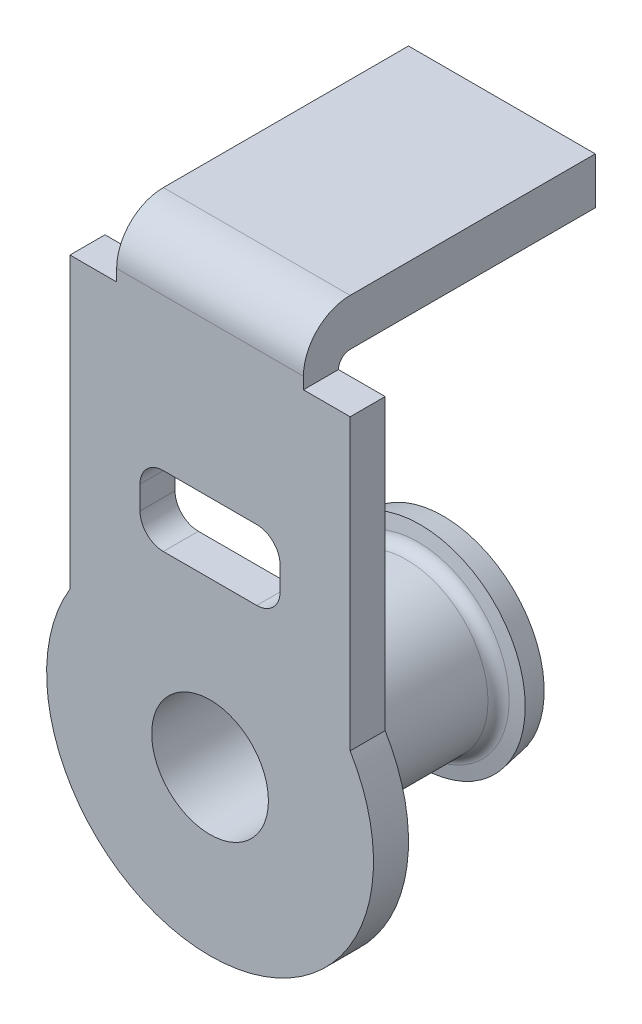
ISO-10303-21;
HEADER;
FILE_DESCRIPTION(('STEP AP214'),'2;1');
FILE_NAME('part.step','',(''),(''),'','','');
FILE_SCHEMA(('AUTOMOTIVE_DESIGN { 1 0 10303 214 1 1 1 1 }'));
ENDSEC;
DATA;
#1=APPLICATION_CONTEXT('core data for automotive mechanical design processes');
#2=APPLICATION_PROTOCOL_DEFINITION('international standard','automotive_design',2000,#1);
#3=PRODUCT_CONTEXT('',#1,'mechanical');
#4=PRODUCT('Part','Part','',(#3));
#5=PRODUCT_RELATED_PRODUCT_CATEGORY('part','',(#4));
#6=PRODUCT_DEFINITION_FORMATION('','',#4);
#7=PRODUCT_DEFINITION_CONTEXT('part definition',#1,'design');
#8=PRODUCT_DEFINITION('design','',#6,#7);
#9=PRODUCT_DEFINITION_SHAPE('','',#8);
#10=(LENGTH_UNIT() NAMED_UNIT(*) SI_UNIT(.MILLI.,.METRE.));
#11=(NAMED_UNIT(*) PLANE_ANGLE_UNIT() SI_UNIT($,.RADIAN.));
#12=(NAMED_UNIT(*) SI_UNIT($,.STERADIAN.) SOLID_ANGLE_UNIT());
#13=UNCERTAINTY_MEASURE_WITH_UNIT(LENGTH_MEASURE(1.E-05),#10,'distance_accuracy_value','');
#14=(GEOMETRIC_REPRESENTATION_CONTEXT(3) GLOBAL_UNCERTAINTY_ASSIGNED_CONTEXT((#13)) GLOBAL_UNIT_ASSIGNED_CONTEXT((#10,
#11,#12)) REPRESENTATION_CONTEXT('',''));
#15=CARTESIAN_POINT('',(0.,0.,0.));
#16=DIRECTION('',(0.,0.,1.));
#17=DIRECTION('',(1.,0.,0.));
#18=AXIS2_PLACEMENT_3D('',#15,#16,#17);
#19=CARTESIAN_POINT('',(0.,-1.,-7.84041232037));
#20=DIRECTION('',(0.,0.,1.));
#21=DIRECTION('',(1.,0.,0.));
#22=AXIS2_PLACEMENT_3D('',#19,#20,#21);
#23=TOROIDAL_SURFACE('',#22,0.400000000000007,0.0500000000000045);
#24=CARTESIAN_POINT('',(0.,-0.999999999999998,-7.88965270802));
#25=DIRECTION('',(0.,0.,-1.));
#26=DIRECTION('',(-1.,0.,0.));
#27=AXIS2_PLACEMENT_3D('',#24,#25,#26);
#28=CIRCLE('',#27,0.391317591117004);
#29=CARTESIAN_POINT('',(-0.391317591117001,-0.999999999999998,-7.88965270802));
#30=VERTEX_POINT('',#29);
#31=EDGE_CURVE('E210',#30,#30,#28,.T.);
#32=ORIENTED_EDGE('',*,*,#31,.F.);
#33=EDGE_LOOP('',(#32));
#34=FACE_BOUND('',#33,.T.);
#35=CARTESIAN_POINT('',(0.,-0.999999999999999,-7.84041232037));
#36=DIRECTION('',(0.,0.,1.));
#37=DIRECTION('',(1.,0.,0.));
#38=AXIS2_PLACEMENT_3D('',#35,#36,#37);
#39=CIRCLE('',#38,0.349999999999999);
#40=CARTESIAN_POINT('',(0.35,-0.999999999999999,-7.84041232037));
#41=VERTEX_POINT('',#40);
#42=EDGE_CURVE('E205',#41,#41,#39,.T.);
#43=ORIENTED_EDGE('',*,*,#42,.F.);
#44=EDGE_LOOP('',(#43));
#45=FACE_BOUND('',#44,.T.);
#46=ADVANCED_FACE('F17',(#34,#45),#23,.F.);
#47=CARTESIAN_POINT('',(0.,-1.,-7.8999999999988));
#48=DIRECTION('',(0.,0.,-1.));
#49=DIRECTION('',(-1.,0.,0.));
#50=AXIS2_PLACEMENT_3D('',#47,#48,#49);
#51=CONICAL_SURFACE('',#50,0.450000000000209,1.39626340160002);
#52=ORIENTED_EDGE('',*,*,#31,.T.);
#53=EDGE_LOOP('',(#52));
#54=FACE_BOUND('',#53,.T.);
#55=CARTESIAN_POINT('',(0.,-1.,-7.8999999999999));
#56=DIRECTION('',(0.,0.,-1.));
#57=DIRECTION('',(-1.,0.,0.));
#58=AXIS2_PLACEMENT_3D('',#55,#56,#57);
#59=CIRCLE('',#58,0.449999999999455);
#60=CARTESIAN_POINT('',(-0.449999999999459,-1.,-7.8999999999999));
#61=VERTEX_POINT('',#60);
#62=EDGE_CURVE('E175',#61,#61,#59,.T.);
#63=ORIENTED_EDGE('',*,*,#62,.F.);
#64=EDGE_LOOP('',(#63));
#65=FACE_BOUND('',#64,.T.);
#66=ADVANCED_FACE('F670',(#54,#65),#51,.T.);
#67=CARTESIAN_POINT('',(0.,-0.999999999999999,-7.15));
#68=DIRECTION('',(0.,0.,-1.));
#69=DIRECTION('',(-1.,0.,0.));
#70=AXIS2_PLACEMENT_3D('',#67,#68,#69);
#71=CYLINDRICAL_SURFACE('',#70,0.349999999999999);
#72=ORIENTED_EDGE('',*,*,#42,.T.);
#73=EDGE_LOOP('',(#72));
#74=FACE_BOUND('',#73,.T.);
#75=CARTESIAN_POINT('',(0.,-0.999999999999999,-7.15));
#76=DIRECTION('',(0.,0.,-1.));
#77=DIRECTION('',(-1.,0.,0.));
#78=AXIS2_PLACEMENT_3D('',#75,#76,#77);
#79=CIRCLE('',#78,0.349999999999999);
#80=CARTESIAN_POINT('',(-0.349999999999999,-0.999999999999999,-7.15));
#81=VERTEX_POINT('',#80);
#82=EDGE_CURVE('E21',#81,#81,#79,.F.);
#83=ORIENTED_EDGE('',*,*,#82,.F.);
#84=EDGE_LOOP('',(#83));
#85=FACE_BOUND('',#84,.T.);
#86=ADVANCED_FACE('F661',(#74,#85),#71,.T.);
#87=CARTESIAN_POINT('',(0.,-1.,-7.8999999999999));
#88=DIRECTION('',(0.,0.,1.));
#89=DIRECTION('',(1.,0.,0.));
#90=AXIS2_PLACEMENT_3D('',#87,#88,#89);
#91=CONICAL_SURFACE('',#90,0.449999999999456,0.174532925199069);
#92=CARTESIAN_POINT('',(0.,-0.999999999999997,-7.9984807752988));
#93=DIRECTION('',(0.,0.,-1.));
#94=DIRECTION('',(-1.,0.,0.));
#95=AXIS2_PLACEMENT_3D('',#92,#93,#94);
#96=CIRCLE('',#95,0.432635182233215);
#97=CARTESIAN_POINT('',(-0.432635182233211,-0.999999999999997,-7.9984807752988));
#98=VERTEX_POINT('',#97);
#99=EDGE_CURVE('E277',#98,#98,#96,.T.);
#100=ORIENTED_EDGE('',*,*,#99,.F.);
#101=EDGE_LOOP('',(#100));
#102=FACE_BOUND('',#101,.T.);
#103=ORIENTED_EDGE('',*,*,#62,.T.);
#104=EDGE_LOOP('',(#103));
#105=FACE_BOUND('',#104,.T.);
#106=ADVANCED_FACE('F653',(#102,#105),#91,.T.);
#107=CARTESIAN_POINT('',(0.401,0.649771809401,-7.199));
#108=DIRECTION('',(0.,-1.,0.));
#109=DIRECTION('',(-1.,0.,0.));
#110=AXIS2_PLACEMENT_3D('',#107,#108,#109);
#111=PLANE('',#110);
#112=DIRECTION('',(-1.,0.,0.));
#113=VECTOR('',#112,1.);
#114=CARTESIAN_POINT('',(0.,0.649771809401,-8.25));
#115=LINE('',#114,#113);
#116=CARTESIAN_POINT('',(0.4,0.649771809401,-8.25));
#117=VERTEX_POINT('',#116);
#118=CARTESIAN_POINT('',(-0.4,0.649771809401,-8.25));
#119=VERTEX_POINT('',#118);
#120=EDGE_CURVE('E136',#117,#119,#115,.T.);
#121=ORIENTED_EDGE('',*,*,#120,.F.);
#122=DIRECTION('',(0.,0.,-1.));
#123=VECTOR('',#122,1.);
#124=CARTESIAN_POINT('',(0.4,0.649771809401,-7.625));
#125=LINE('',#124,#123);
#126=CARTESIAN_POINT('',(0.4,0.649771809401,-7.2));
#127=VERTEX_POINT('',#126);
#128=EDGE_CURVE('E165',#127,#117,#125,.T.);
#129=ORIENTED_EDGE('',*,*,#128,.F.);
#130=DIRECTION('',(1.,0.,0.));
#131=VECTOR('',#130,1.);
#132=CARTESIAN_POINT('',(0.,0.649771809401,-7.2));
#133=LINE('',#132,#131);
#134=CARTESIAN_POINT('',(-0.4,0.649771809401,-7.2));
#135=VERTEX_POINT('',#134);
#136=EDGE_CURVE('E126',#135,#127,#133,.T.);
#137=ORIENTED_EDGE('',*,*,#136,.F.);
#138=DIRECTION('',(0.,0.,1.));
#139=VECTOR('',#138,1.);
#140=CARTESIAN_POINT('',(-0.4,0.649771809401,-7.625));
#141=LINE('',#140,#139);
#142=EDGE_CURVE('E199',#119,#135,#141,.T.);
#143=ORIENTED_EDGE('',*,*,#142,.F.);
#144=EDGE_LOOP('',(#121,#129,#137,#143));
#145=FACE_BOUND('',#144,.T.);
#146=ADVANCED_FACE('F645',(#145),#111,.T.);
#147=CARTESIAN_POINT('',(-0.401,0.851,-8.25));
#148=DIRECTION('',(0.,0.,-1.));
#149=DIRECTION('',(1.,0.,0.));
#150=AXIS2_PLACEMENT_3D('',#147,#148,#149);
#151=PLANE('',#150);
#152=DIRECTION('',(-1.,0.,0.));
#153=VECTOR('',#152,1.);
#154=CARTESIAN_POINT('',(0.,0.85,-8.25));
#155=LINE('',#154,#153);
#156=CARTESIAN_POINT('',(0.4,0.85,-8.25));
#157=VERTEX_POINT('',#156);
#158=CARTESIAN_POINT('',(-0.4,0.85,-8.25));
#159=VERTEX_POINT('',#158);
#160=EDGE_CURVE('E141',#157,#159,#155,.T.);
#161=ORIENTED_EDGE('',*,*,#160,.F.);
#162=DIRECTION('',(0.,1.,0.));
#163=VECTOR('',#162,1.);
#164=CARTESIAN_POINT('',(0.4,0.7248859047005,-8.25));
#165=LINE('',#164,#163);
#166=EDGE_CURVE('E145',#117,#157,#165,.T.);
#167=ORIENTED_EDGE('',*,*,#166,.F.);
#168=ORIENTED_EDGE('',*,*,#120,.T.);
#169=DIRECTION('',(0.,-1.,0.));
#170=VECTOR('',#169,1.);
#171=CARTESIAN_POINT('',(-0.4,0.7248859047005,-8.25));
#172=LINE('',#171,#170);
#173=EDGE_CURVE('E148',#159,#119,#172,.T.);
#174=ORIENTED_EDGE('',*,*,#173,.F.);
#175=EDGE_LOOP('',(#161,#167,#168,#174));
#176=FACE_BOUND('',#175,.T.);
#177=ADVANCED_FACE('F143',(#176),#151,.T.);
#178=CARTESIAN_POINT('',(-0.4,0.599771809401,-7.2));
#179=DIRECTION('',(1.,0.,0.));
#180=DIRECTION('',(0.,0.,-1.));
#181=AXIS2_PLACEMENT_3D('',#178,#179,#180);
#182=CYLINDRICAL_SURFACE('',#181,0.0500000000000007);
#183=ORIENTED_EDGE('',*,*,#136,.T.);
#184=CARTESIAN_POINT('',(0.4,0.599771809401,-7.2));
#185=DIRECTION('',(1.,0.,0.));
#186=DIRECTION('',(0.,0.,-1.));
#187=AXIS2_PLACEMENT_3D('',#184,#185,#186);
#188=CIRCLE('',#187,0.0500000000000007);
#189=CARTESIAN_POINT('',(0.4,0.599771809401,-7.15));
#190=VERTEX_POINT('',#189);
#191=EDGE_CURVE('E258',#190,#127,#188,.F.);
#192=ORIENTED_EDGE('',*,*,#191,.F.);
#193=DIRECTION('',(1.,0.,0.));
#194=VECTOR('',#193,1.);
#195=CARTESIAN_POINT('',(0.,0.599771809401,-7.15));
#196=LINE('',#195,#194);
#197=CARTESIAN_POINT('',(-0.4,0.599771809401,-7.15));
#198=VERTEX_POINT('',#197);
#199=EDGE_CURVE('E151',#198,#190,#196,.T.);
#200=ORIENTED_EDGE('',*,*,#199,.F.);
#201=CARTESIAN_POINT('',(-0.4,0.599771809401,-7.2));
#202=DIRECTION('',(1.,0.,0.));
#203=DIRECTION('',(0.,0.,-1.));
#204=AXIS2_PLACEMENT_3D('',#201,#202,#203);
#205=CIRCLE('',#204,0.0500000000000007);
#206=EDGE_CURVE('E261',#135,#198,#205,.T.);
#207=ORIENTED_EDGE('',*,*,#206,.F.);
#208=EDGE_LOOP('',(#183,#192,#200,#207));
#209=FACE_BOUND('',#208,.T.);
#210=ADVANCED_FACE('F629',(#209),#182,.F.);
#211=CARTESIAN_POINT('',(0.401,0.85,-8.251));
#212=DIRECTION('',(0.,1.,0.));
#213=DIRECTION('',(-1.,0.,0.));
#214=AXIS2_PLACEMENT_3D('',#211,#212,#213);
#215=PLANE('',#214);
#216=ORIENTED_EDGE('',*,*,#160,.T.);
#217=DIRECTION('',(0.,0.,-1.));
#218=VECTOR('',#217,1.);
#219=CARTESIAN_POINT('',(-0.4,0.85,-7.625));
#220=LINE('',#219,#218);
#221=CARTESIAN_POINT('',(-0.4,0.85,-7.2));
#222=VERTEX_POINT('',#221);
#223=EDGE_CURVE('E200',#222,#159,#220,.T.);
#224=ORIENTED_EDGE('',*,*,#223,.F.);
#225=DIRECTION('',(-1.,0.,0.));
#226=VECTOR('',#225,1.);
#227=CARTESIAN_POINT('',(0.,0.85,-7.2));
#228=LINE('',#227,#226);
#229=CARTESIAN_POINT('',(0.4,0.85,-7.2));
#230=VERTEX_POINT('',#229);
#231=EDGE_CURVE('E157',#230,#222,#228,.T.);
#232=ORIENTED_EDGE('',*,*,#231,.F.);
#233=DIRECTION('',(0.,0.,1.));
#234=VECTOR('',#233,1.);
#235=CARTESIAN_POINT('',(0.4,0.85,-7.625));
#236=LINE('',#235,#234);
#237=EDGE_CURVE('E154',#157,#230,#236,.T.);
#238=ORIENTED_EDGE('',*,*,#237,.F.);
#239=EDGE_LOOP('',(#216,#224,#232,#238));
#240=FACE_BOUND('',#239,.T.);
#241=ADVANCED_FACE('F155',(#240),#215,.T.);
#242=CARTESIAN_POINT('',(0.907143603825974,-1.91929572084614,-7.15));
#243=DIRECTION('',(0.,0.,-1.));
#244=DIRECTION('',(-1.,0.,0.));
#245=AXIS2_PLACEMENT_3D('',#242,#243,#244);
#246=PLANE('',#245);
#247=CARTESIAN_POINT('',(0.2,-0.2,-7.15));
#248=DIRECTION('',(0.,0.,1.));
#249=DIRECTION('',(1.,0.,0.));
#250=AXIS2_PLACEMENT_3D('',#247,#248,#249);
#251=CIRCLE('',#250,0.1);
#252=CARTESIAN_POINT('',(0.3,-0.2,-7.15));
#253=VERTEX_POINT('',#252);
#254=CARTESIAN_POINT('',(0.2,-0.3,-7.15));
#255=VERTEX_POINT('',#254);
#256=EDGE_CURVE('E246',#253,#255,#251,.F.);
#257=ORIENTED_EDGE('',*,*,#256,.F.);
#258=DIRECTION('',(0.,-1.,0.));
#259=VECTOR('',#258,1.);
#260=CARTESIAN_POINT('',(0.3,-0.15,-7.15));
#261=LINE('',#260,#259);
#262=CARTESIAN_POINT('',(0.3,-0.1,-7.15));
#263=VERTEX_POINT('',#262);
#264=EDGE_CURVE('E292',#263,#253,#261,.T.);
#265=ORIENTED_EDGE('',*,*,#264,.F.);
#266=CARTESIAN_POINT('',(0.2,-0.1,-7.15));
#267=DIRECTION('',(0.,0.,1.));
#268=DIRECTION('',(1.,0.,0.));
#269=AXIS2_PLACEMENT_3D('',#266,#267,#268);
#270=CIRCLE('',#269,0.1);
#271=CARTESIAN_POINT('',(0.2,0.,-7.15));
#272=VERTEX_POINT('',#271);
#273=EDGE_CURVE('E250',#272,#263,#270,.F.);
#274=ORIENTED_EDGE('',*,*,#273,.F.);
#275=DIRECTION('',(1.,0.,0.));
#276=VECTOR('',#275,1.);
#277=CARTESIAN_POINT('',(0.,0.,-7.15));
#278=LINE('',#277,#276);
#279=CARTESIAN_POINT('',(-0.2,0.,-7.15));
#280=VERTEX_POINT('',#279);
#281=EDGE_CURVE('E284',#280,#272,#278,.T.);
#282=ORIENTED_EDGE('',*,*,#281,.F.);
#283=CARTESIAN_POINT('',(-0.2,-0.1,-7.15));
#284=DIRECTION('',(0.,0.,1.));
#285=DIRECTION('',(0.,-1.,0.));
#286=AXIS2_PLACEMENT_3D('',#283,#284,#285);
#287=CIRCLE('',#286,0.1);
#288=CARTESIAN_POINT('',(-0.3,-0.1,-7.15));
#289=VERTEX_POINT('',#288);
#290=EDGE_CURVE('E239',#289,#280,#287,.F.);
#291=ORIENTED_EDGE('',*,*,#290,.F.);
#292=DIRECTION('',(0.,1.,0.));
#293=VECTOR('',#292,1.);
#294=CARTESIAN_POINT('',(-0.3,-0.15,-7.15));
#295=LINE('',#294,#293);
#296=CARTESIAN_POINT('',(-0.3,-0.2,-7.15));
#297=VERTEX_POINT('',#296);
#298=EDGE_CURVE('E288',#297,#289,#295,.T.);
#299=ORIENTED_EDGE('',*,*,#298,.F.);
#300=CARTESIAN_POINT('',(-0.2,-0.2,-7.15));
#301=DIRECTION('',(0.,0.,1.));
#302=DIRECTION('',(1.,0.,0.));
#303=AXIS2_PLACEMENT_3D('',#300,#301,#302);
#304=CIRCLE('',#303,0.1);
#305=CARTESIAN_POINT('',(-0.2,-0.3,-7.15));
#306=VERTEX_POINT('',#305);
#307=EDGE_CURVE('E242',#306,#297,#304,.F.);
#308=ORIENTED_EDGE('',*,*,#307,.F.);
#309=DIRECTION('',(-1.,0.,0.));
#310=VECTOR('',#309,1.);
#311=CARTESIAN_POINT('',(0.,-0.3,-7.15));
#312=LINE('',#311,#310);
#313=EDGE_CURVE('E290',#255,#306,#312,.T.);
#314=ORIENTED_EDGE('',*,*,#313,.F.);
#315=EDGE_LOOP('',(#257,#265,#274,#282,#291,#299,#308,#314));
#316=FACE_BOUND('',#315,.T.);
#317=ORIENTED_EDGE('',*,*,#82,.T.);
#318=EDGE_LOOP('',(#317));
#319=FACE_BOUND('',#318,.T.);
#320=DIRECTION('',(0.,-1.,0.));
#321=VECTOR('',#320,1.);
#322=CARTESIAN_POINT('',(-0.6,-0.0198365315265,-7.15));
#323=LINE('',#322,#321);
#324=CARTESIAN_POINT('',(-0.6,0.599771809401,-7.15));
#325=VERTEX_POINT('',#324);
#326=CARTESIAN_POINT('',(-0.599999999999969,-0.639444872453546,-7.15));
#327=VERTEX_POINT('',#326);
#328=EDGE_CURVE('E186',#325,#327,#323,.T.);
#329=ORIENTED_EDGE('',*,*,#328,.F.);
#330=DIRECTION('',(-1.,0.,0.));
#331=VECTOR('',#330,1.);
#332=CARTESIAN_POINT('',(-0.5,0.599771809401,-7.15));
#333=LINE('',#332,#331);
#334=EDGE_CURVE('E192',#198,#325,#333,.T.);
#335=ORIENTED_EDGE('',*,*,#334,.F.);
#336=ORIENTED_EDGE('',*,*,#199,.T.);
#337=DIRECTION('',(-1.,0.,0.));
#338=VECTOR('',#337,1.);
#339=CARTESIAN_POINT('',(0.5,0.599771809401,-7.15));
#340=LINE('',#339,#338);
#341=CARTESIAN_POINT('',(0.6,0.599771809401,-7.15));
#342=VERTEX_POINT('',#341);
#343=EDGE_CURVE('E167',#342,#190,#340,.T.);
#344=ORIENTED_EDGE('',*,*,#343,.F.);
#345=DIRECTION('',(0.,1.,0.));
#346=VECTOR('',#345,1.);
#347=CARTESIAN_POINT('',(0.6,-0.0198365315265,-7.15));
#348=LINE('',#347,#346);
#349=CARTESIAN_POINT('',(0.6,-0.639444872453222,-7.15));
#350=VERTEX_POINT('',#349);
#351=EDGE_CURVE('E179',#350,#342,#348,.T.);
#352=ORIENTED_EDGE('',*,*,#351,.F.);
#353=CARTESIAN_POINT('',(3.4577917785994E-13,-0.999999999999935,-7.15));
#354=DIRECTION('',(0.,0.,-1.));
#355=DIRECTION('',(-1.,0.,0.));
#356=AXIS2_PLACEMENT_3D('',#353,#354,#355);
#357=CIRCLE('',#356,0.700000000000267);
#358=EDGE_CURVE('E260',#327,#350,#357,.F.);
#359=ORIENTED_EDGE('',*,*,#358,.F.);
#360=EDGE_LOOP('',(#329,#335,#336,#344,#352,#359));
#361=FACE_BOUND('',#360,.T.);
#362=ADVANCED_FACE('F396',(#316,#319,#361),#246,.T.);
#363=CARTESIAN_POINT('',(0.,-0.999999999999999,-7.98813348332));
#364=DIRECTION('',(0.,0.,-1.));
#365=DIRECTION('',(-1.,0.,0.));
#366=AXIS2_PLACEMENT_3D('',#363,#364,#365);
#367=CONICAL_SURFACE('',#366,0.373952773349999,1.39626340160007);
#368=ORIENTED_EDGE('',*,*,#99,.T.);
#369=EDGE_LOOP('',(#368));
#370=FACE_BOUND('',#369,.T.);
#371=CARTESIAN_POINT('',(0.,-1.,-7.98813348332178));
#372=DIRECTION('',(0.,0.,-1.));
#373=DIRECTION('',(-1.,0.,0.));
#374=AXIS2_PLACEMENT_3D('',#371,#372,#373);
#375=CIRCLE('',#374,0.373952773349689);
#376=CARTESIAN_POINT('',(-0.373952773349692,-1.,-7.98813348332178));
#377=VERTEX_POINT('',#376);
#378=EDGE_CURVE('E329',#377,#377,#375,.T.);
#379=ORIENTED_EDGE('',*,*,#378,.F.);
#380=EDGE_LOOP('',(#379));
#381=FACE_BOUND('',#380,.T.);
#382=ADVANCED_FACE('F411',(#370,#381),#367,.F.);
#383=CARTESIAN_POINT('',(-0.4,0.598771809401,-6.999));
#384=DIRECTION('',(-1.,0.,0.));
#385=DIRECTION('',(0.,1.,0.));
#386=AXIS2_PLACEMENT_3D('',#383,#384,#385);
#387=PLANE('',#386);
#388=ORIENTED_EDGE('',*,*,#142,.T.);
#389=ORIENTED_EDGE('',*,*,#206,.T.);
#390=DIRECTION('',(0.,0.,-1.));
#391=VECTOR('',#390,1.);
#392=CARTESIAN_POINT('',(-0.4,0.599771809401,-7.075));
#393=LINE('',#392,#391);
#394=CARTESIAN_POINT('',(-0.4,0.599771809401,-7.));
#395=VERTEX_POINT('',#394);
#396=EDGE_CURVE('E195',#395,#198,#393,.T.);
#397=ORIENTED_EDGE('',*,*,#396,.F.);
#398=DIRECTION('',(0.,-1.,0.));
#399=VECTOR('',#398,1.);
#400=CARTESIAN_POINT('',(-0.4,-0.63414786042307,-7.));
#401=LINE('',#400,#399);
#402=CARTESIAN_POINT('',(-0.4,0.65,-7.));
#403=VERTEX_POINT('',#402);
#404=EDGE_CURVE('E324',#403,#395,#401,.T.);
#405=ORIENTED_EDGE('',*,*,#404,.F.);
#406=CARTESIAN_POINT('',(-0.4,0.650000000000001,-7.2));
#407=DIRECTION('',(-1.,0.,0.));
#408=DIRECTION('',(0.,0.,1.));
#409=AXIS2_PLACEMENT_3D('',#406,#407,#408);
#410=CIRCLE('',#409,0.2);
#411=EDGE_CURVE('E253',#222,#403,#410,.F.);
#412=ORIENTED_EDGE('',*,*,#411,.F.);
#413=ORIENTED_EDGE('',*,*,#223,.T.);
#414=ORIENTED_EDGE('',*,*,#173,.T.);
#415=EDGE_LOOP('',(#388,#389,#397,#405,#412,#413,#414));
#416=FACE_BOUND('',#415,.T.);
#417=ADVANCED_FACE('F409',(#416),#387,.T.);
#418=CARTESIAN_POINT('',(-0.399,0.599771809401,-7.151));
#419=DIRECTION('',(0.,1.,0.));
#420=DIRECTION('',(-1.,0.,0.));
#421=AXIS2_PLACEMENT_3D('',#418,#419,#420);
#422=PLANE('',#421);
#423=ORIENTED_EDGE('',*,*,#334,.T.);
#424=DIRECTION('',(0.,0.,-1.));
#425=VECTOR('',#424,1.);
#426=CARTESIAN_POINT('',(-0.6,0.599771809401,-7.075));
#427=LINE('',#426,#425);
#428=CARTESIAN_POINT('',(-0.6,0.599771809401,-7.));
#429=VERTEX_POINT('',#428);
#430=EDGE_CURVE('E189',#429,#325,#427,.T.);
#431=ORIENTED_EDGE('',*,*,#430,.F.);
#432=DIRECTION('',(-1.,0.,0.));
#433=VECTOR('',#432,1.);
#434=CARTESIAN_POINT('',(0.,0.599771809401,-7.));
#435=LINE('',#434,#433);
#436=EDGE_CURVE('E321',#395,#429,#435,.T.);
#437=ORIENTED_EDGE('',*,*,#436,.F.);
#438=ORIENTED_EDGE('',*,*,#396,.T.);
#439=EDGE_LOOP('',(#423,#431,#437,#438));
#440=FACE_BOUND('',#439,.T.);
#441=ADVANCED_FACE('F393',(#440),#422,.T.);
#442=CARTESIAN_POINT('',(-0.6,0.600771809401,-7.151));
#443=DIRECTION('',(-1.,0.,0.));
#444=DIRECTION('',(0.,-1.,0.));
#445=AXIS2_PLACEMENT_3D('',#442,#443,#444);
#446=PLANE('',#445);
#447=DIRECTION('',(0.,0.,-1.));
#448=VECTOR('',#447,1.);
#449=CARTESIAN_POINT('',(-0.599999999999938,-0.639444872453498,-7.075));
#450=LINE('',#449,#448);
#451=CARTESIAN_POINT('',(-0.599999999999969,-0.639444872453547,-7.));
#452=VERTEX_POINT('',#451);
#453=EDGE_CURVE('E188',#452,#327,#450,.T.);
#454=ORIENTED_EDGE('',*,*,#453,.F.);
#455=DIRECTION('',(0.,-1.,0.));
#456=VECTOR('',#455,1.);
#457=CARTESIAN_POINT('',(-0.6,-0.63414786042307,-7.));
#458=LINE('',#457,#456);
#459=EDGE_CURVE('E238',#429,#452,#458,.T.);
#460=ORIENTED_EDGE('',*,*,#459,.F.);
#461=ORIENTED_EDGE('',*,*,#430,.T.);
#462=ORIENTED_EDGE('',*,*,#328,.T.);
#463=EDGE_LOOP('',(#454,#460,#461,#462));
#464=FACE_BOUND('',#463,.T.);
#465=ADVANCED_FACE('F384',(#464),#446,.T.);
#466=CARTESIAN_POINT('',(3.4577917785994E-13,-0.999999999999935,-7.));
#467=DIRECTION('',(0.,0.,-1.));
#468=DIRECTION('',(-1.,0.,0.));
#469=AXIS2_PLACEMENT_3D('',#466,#467,#468);
#470=CYLINDRICAL_SURFACE('',#469,0.700000000000267);
#471=DIRECTION('',(0.,0.,-1.));
#472=VECTOR('',#471,1.);
#473=CARTESIAN_POINT('',(0.6,-0.639444872454,-7.075));
#474=LINE('',#473,#472);
#475=CARTESIAN_POINT('',(0.6,-0.639444872453222,-7.));
#476=VERTEX_POINT('',#475);
#477=EDGE_CURVE('E183',#476,#350,#474,.T.);
#478=ORIENTED_EDGE('',*,*,#477,.F.);
#479=CARTESIAN_POINT('',(3.4577917785994E-13,-0.999999999999935,-7.));
#480=DIRECTION('',(0.,0.,-1.));
#481=DIRECTION('',(-1.,0.,0.));
#482=AXIS2_PLACEMENT_3D('',#479,#480,#481);
#483=CIRCLE('',#482,0.700000000000267);
#484=EDGE_CURVE('E234',#452,#476,#483,.F.);
#485=ORIENTED_EDGE('',*,*,#484,.F.);
#486=ORIENTED_EDGE('',*,*,#453,.T.);
#487=ORIENTED_EDGE('',*,*,#358,.T.);
#488=EDGE_LOOP('',(#478,#485,#486,#487));
#489=FACE_BOUND('',#488,.T.);
#490=ADVANCED_FACE('F399',(#489),#470,.T.);
#491=CARTESIAN_POINT('',(0.6,-0.640444872454,-7.151));
#492=DIRECTION('',(1.,0.,0.));
#493=DIRECTION('',(0.,1.,0.));
#494=AXIS2_PLACEMENT_3D('',#491,#492,#493);
#495=PLANE('',#494);
#496=ORIENTED_EDGE('',*,*,#477,.T.);
#497=ORIENTED_EDGE('',*,*,#351,.T.);
#498=DIRECTION('',(0.,0.,-1.));
#499=VECTOR('',#498,1.);
#500=CARTESIAN_POINT('',(0.6,0.599771809401,-7.075));
#501=LINE('',#500,#499);
#502=CARTESIAN_POINT('',(0.6,0.599771809401,-7.));
#503=VERTEX_POINT('',#502);
#504=EDGE_CURVE('E182',#503,#342,#501,.T.);
#505=ORIENTED_EDGE('',*,*,#504,.F.);
#506=DIRECTION('',(0.,1.,0.));
#507=VECTOR('',#506,1.);
#508=CARTESIAN_POINT('',(0.6,-0.63414786042307,-7.));
#509=LINE('',#508,#507);
#510=EDGE_CURVE('E237',#476,#503,#509,.T.);
#511=ORIENTED_EDGE('',*,*,#510,.F.);
#512=EDGE_LOOP('',(#496,#497,#505,#511));
#513=FACE_BOUND('',#512,.T.);
#514=ADVANCED_FACE('F401',(#513),#495,.T.);
#515=CARTESIAN_POINT('',(0.601,0.599771809401,-7.151));
#516=DIRECTION('',(0.,1.,0.));
#517=DIRECTION('',(-1.,0.,0.));
#518=AXIS2_PLACEMENT_3D('',#515,#516,#517);
#519=PLANE('',#518);
#520=ORIENTED_EDGE('',*,*,#343,.T.);
#521=DIRECTION('',(0.,0.,-1.));
#522=VECTOR('',#521,1.);
#523=CARTESIAN_POINT('',(0.4,0.599771809401,-7.625));
#524=LINE('',#523,#522);
#525=CARTESIAN_POINT('',(0.4,0.599771809401,-7.));
#526=VERTEX_POINT('',#525);
#527=EDGE_CURVE('E160',#526,#190,#524,.T.);
#528=ORIENTED_EDGE('',*,*,#527,.F.);
#529=DIRECTION('',(-1.,0.,0.));
#530=VECTOR('',#529,1.);
#531=CARTESIAN_POINT('',(0.,0.599771809401,-7.));
#532=LINE('',#531,#530);
#533=EDGE_CURVE('E368',#503,#526,#532,.T.);
#534=ORIENTED_EDGE('',*,*,#533,.F.);
#535=ORIENTED_EDGE('',*,*,#504,.T.);
#536=EDGE_LOOP('',(#520,#528,#534,#535));
#537=FACE_BOUND('',#536,.T.);
#538=ADVANCED_FACE('F402',(#537),#519,.T.);
#539=CARTESIAN_POINT('',(0.4,0.851,-6.999));
#540=DIRECTION('',(1.,0.,0.));
#541=DIRECTION('',(0.,-1.,0.));
#542=AXIS2_PLACEMENT_3D('',#539,#540,#541);
#543=PLANE('',#542);
#544=ORIENTED_EDGE('',*,*,#527,.T.);
#545=ORIENTED_EDGE('',*,*,#191,.T.);
#546=ORIENTED_EDGE('',*,*,#128,.T.);
#547=ORIENTED_EDGE('',*,*,#166,.T.);
#548=ORIENTED_EDGE('',*,*,#237,.T.);
#549=CARTESIAN_POINT('',(0.4,0.650000000000001,-7.2));
#550=DIRECTION('',(-1.,0.,0.));
#551=DIRECTION('',(0.,0.,1.));
#552=AXIS2_PLACEMENT_3D('',#549,#550,#551);
#553=CIRCLE('',#552,0.2);
#554=CARTESIAN_POINT('',(0.4,0.65,-7.));
#555=VERTEX_POINT('',#554);
#556=EDGE_CURVE('E256',#555,#230,#553,.T.);
#557=ORIENTED_EDGE('',*,*,#556,.F.);
#558=DIRECTION('',(0.,1.,0.));
#559=VECTOR('',#558,1.);
#560=CARTESIAN_POINT('',(0.4,-0.63414786042307,-7.));
#561=LINE('',#560,#559);
#562=EDGE_CURVE('E365',#526,#555,#561,.T.);
#563=ORIENTED_EDGE('',*,*,#562,.F.);
#564=EDGE_LOOP('',(#544,#545,#546,#547,#548,#557,#563));
#565=FACE_BOUND('',#564,.T.);
#566=ADVANCED_FACE('F163',(#565),#543,.T.);
#567=CARTESIAN_POINT('',(0.4,0.650000000000001,-7.2));
#568=DIRECTION('',(-1.,0.,0.));
#569=DIRECTION('',(0.,0.,1.));
#570=AXIS2_PLACEMENT_3D('',#567,#568,#569);
#571=CYLINDRICAL_SURFACE('',#570,0.2);
#572=ORIENTED_EDGE('',*,*,#411,.T.);
#573=DIRECTION('',(-1.,0.,0.));
#574=VECTOR('',#573,1.);
#575=CARTESIAN_POINT('',(0.,0.65,-7.));
#576=LINE('',#575,#574);
#577=EDGE_CURVE('E233',#555,#403,#576,.T.);
#578=ORIENTED_EDGE('',*,*,#577,.F.);
#579=ORIENTED_EDGE('',*,*,#556,.T.);
#580=ORIENTED_EDGE('',*,*,#231,.T.);
#581=EDGE_LOOP('',(#572,#578,#579,#580));
#582=FACE_BOUND('',#581,.T.);
#583=ADVANCED_FACE('F407',(#582),#571,.T.);
#584=CARTESIAN_POINT('',(0.2,-0.1,-7.15));
#585=DIRECTION('',(0.,0.,1.));
#586=DIRECTION('',(1.,0.,0.));
#587=AXIS2_PLACEMENT_3D('',#584,#585,#586);
#588=CYLINDRICAL_SURFACE('',#587,0.1);
#589=ORIENTED_EDGE('',*,*,#273,.T.);
#590=DIRECTION('',(0.,0.,-1.));
#591=VECTOR('',#590,1.);
#592=CARTESIAN_POINT('',(0.3,-0.1,-7.075));
#593=LINE('',#592,#591);
#594=CARTESIAN_POINT('',(0.3,-0.1,-7.));
#595=VERTEX_POINT('',#594);
#596=EDGE_CURVE('E252',#595,#263,#593,.T.);
#597=ORIENTED_EDGE('',*,*,#596,.F.);
#598=CARTESIAN_POINT('',(0.2,-0.1,-7.));
#599=DIRECTION('',(0.,0.,1.));
#600=DIRECTION('',(1.,0.,0.));
#601=AXIS2_PLACEMENT_3D('',#598,#599,#600);
#602=CIRCLE('',#601,0.1);
#603=CARTESIAN_POINT('',(0.2,0.,-7.));
#604=VERTEX_POINT('',#603);
#605=EDGE_CURVE('E230',#604,#595,#602,.F.);
#606=ORIENTED_EDGE('',*,*,#605,.F.);
#607=DIRECTION('',(0.,0.,1.));
#608=VECTOR('',#607,1.);
#609=CARTESIAN_POINT('',(0.2,0.,-7.075));
#610=LINE('',#609,#608);
#611=EDGE_CURVE('E287',#272,#604,#610,.T.);
#612=ORIENTED_EDGE('',*,*,#611,.F.);
#613=EDGE_LOOP('',(#589,#597,#606,#612));
#614=FACE_BOUND('',#613,.T.);
#615=ADVANCED_FACE('F467',(#614),#588,.F.);
#616=CARTESIAN_POINT('',(0.3,-0.099,-7.151));
#617=DIRECTION('',(-1.,0.,0.));
#618=DIRECTION('',(0.,-1.,0.));
#619=AXIS2_PLACEMENT_3D('',#616,#617,#618);
#620=PLANE('',#619);
#621=DIRECTION('',(0.,0.,-1.));
#622=VECTOR('',#621,1.);
#623=CARTESIAN_POINT('',(0.3,-0.2,-7.075));
#624=LINE('',#623,#622);
#625=CARTESIAN_POINT('',(0.3,-0.2,-7.));
#626=VERTEX_POINT('',#625);
#627=EDGE_CURVE('E249',#626,#253,#624,.T.);
#628=ORIENTED_EDGE('',*,*,#627,.F.);
#629=DIRECTION('',(0.,-1.,0.));
#630=VECTOR('',#629,1.);
#631=CARTESIAN_POINT('',(0.3,-0.63414786042307,-7.));
#632=LINE('',#631,#630);
#633=EDGE_CURVE('E229',#595,#626,#632,.T.);
#634=ORIENTED_EDGE('',*,*,#633,.F.);
#635=ORIENTED_EDGE('',*,*,#596,.T.);
#636=ORIENTED_EDGE('',*,*,#264,.T.);
#637=EDGE_LOOP('',(#628,#634,#635,#636));
#638=FACE_BOUND('',#637,.T.);
#639=ADVANCED_FACE('F470',(#638),#620,.T.);
#640=CARTESIAN_POINT('',(0.2,-0.2,-7.15));
#641=DIRECTION('',(0.,0.,1.));
#642=DIRECTION('',(1.,0.,0.));
#643=AXIS2_PLACEMENT_3D('',#640,#641,#642);
#644=CYLINDRICAL_SURFACE('',#643,0.1);
#645=ORIENTED_EDGE('',*,*,#256,.T.);
#646=DIRECTION('',(0.,0.,-1.));
#647=VECTOR('',#646,1.);
#648=CARTESIAN_POINT('',(0.2,-0.3,-7.075));
#649=LINE('',#648,#647);
#650=CARTESIAN_POINT('',(0.2,-0.3,-7.));
#651=VERTEX_POINT('',#650);
#652=EDGE_CURVE('E248',#651,#255,#649,.T.);
#653=ORIENTED_EDGE('',*,*,#652,.F.);
#654=CARTESIAN_POINT('',(0.2,-0.2,-7.));
#655=DIRECTION('',(0.,0.,1.));
#656=DIRECTION('',(1.,0.,0.));
#657=AXIS2_PLACEMENT_3D('',#654,#655,#656);
#658=CIRCLE('',#657,0.1);
#659=EDGE_CURVE('E226',#626,#651,#658,.F.);
#660=ORIENTED_EDGE('',*,*,#659,.F.);
#661=ORIENTED_EDGE('',*,*,#627,.T.);
#662=EDGE_LOOP('',(#645,#653,#660,#661));
#663=FACE_BOUND('',#662,.T.);
#664=ADVANCED_FACE('F472',(#663),#644,.F.);
#665=CARTESIAN_POINT('',(0.201,-0.3,-7.151));
#666=DIRECTION('',(0.,1.,0.));
#667=DIRECTION('',(-1.,0.,0.));
#668=AXIS2_PLACEMENT_3D('',#665,#666,#667);
#669=PLANE('',#668);
#670=DIRECTION('',(0.,0.,-1.));
#671=VECTOR('',#670,1.);
#672=CARTESIAN_POINT('',(-0.2,-0.3,-7.075));
#673=LINE('',#672,#671);
#674=CARTESIAN_POINT('',(-0.2,-0.3,-7.));
#675=VERTEX_POINT('',#674);
#676=EDGE_CURVE('E245',#675,#306,#673,.T.);
#677=ORIENTED_EDGE('',*,*,#676,.F.);
#678=DIRECTION('',(-1.,0.,0.));
#679=VECTOR('',#678,1.);
#680=CARTESIAN_POINT('',(0.,-0.3,-7.));
#681=LINE('',#680,#679);
#682=EDGE_CURVE('E225',#651,#675,#681,.T.);
#683=ORIENTED_EDGE('',*,*,#682,.F.);
#684=ORIENTED_EDGE('',*,*,#652,.T.);
#685=ORIENTED_EDGE('',*,*,#313,.T.);
#686=EDGE_LOOP('',(#677,#683,#684,#685));
#687=FACE_BOUND('',#686,.T.);
#688=ADVANCED_FACE('F447',(#687),#669,.T.);
#689=CARTESIAN_POINT('',(-0.2,-0.2,-7.15));
#690=DIRECTION('',(0.,0.,1.));
#691=DIRECTION('',(1.,0.,0.));
#692=AXIS2_PLACEMENT_3D('',#689,#690,#691);
#693=CYLINDRICAL_SURFACE('',#692,0.1);
#694=ORIENTED_EDGE('',*,*,#307,.T.);
#695=DIRECTION('',(0.,0.,-1.));
#696=VECTOR('',#695,1.);
#697=CARTESIAN_POINT('',(-0.3,-0.2,-7.075));
#698=LINE('',#697,#696);
#699=CARTESIAN_POINT('',(-0.3,-0.2,-7.));
#700=VERTEX_POINT('',#699);
#701=EDGE_CURVE('E244',#700,#297,#698,.T.);
#702=ORIENTED_EDGE('',*,*,#701,.F.);
#703=CARTESIAN_POINT('',(-0.2,-0.2,-7.));
#704=DIRECTION('',(0.,0.,1.));
#705=DIRECTION('',(1.,0.,0.));
#706=AXIS2_PLACEMENT_3D('',#703,#704,#705);
#707=CIRCLE('',#706,0.1);
#708=EDGE_CURVE('E222',#675,#700,#707,.F.);
#709=ORIENTED_EDGE('',*,*,#708,.F.);
#710=ORIENTED_EDGE('',*,*,#676,.T.);
#711=EDGE_LOOP('',(#694,#702,#709,#710));
#712=FACE_BOUND('',#711,.T.);
#713=ADVANCED_FACE('F451',(#712),#693,.F.);
#714=CARTESIAN_POINT('',(-0.3,-0.201,-7.151));
#715=DIRECTION('',(1.,0.,0.));
#716=DIRECTION('',(0.,1.,0.));
#717=AXIS2_PLACEMENT_3D('',#714,#715,#716);
#718=PLANE('',#717);
#719=DIRECTION('',(0.,0.,-1.));
#720=VECTOR('',#719,1.);
#721=CARTESIAN_POINT('',(-0.3,-0.1,-7.075));
#722=LINE('',#721,#720);
#723=CARTESIAN_POINT('',(-0.3,-0.100000000000001,-7.));
#724=VERTEX_POINT('',#723);
#725=EDGE_CURVE('E241',#724,#289,#722,.T.);
#726=ORIENTED_EDGE('',*,*,#725,.F.);
#727=DIRECTION('',(0.,1.,0.));
#728=VECTOR('',#727,1.);
#729=CARTESIAN_POINT('',(-0.3,-0.63414786042307,-7.));
#730=LINE('',#729,#728);
#731=EDGE_CURVE('E221',#700,#724,#730,.T.);
#732=ORIENTED_EDGE('',*,*,#731,.F.);
#733=ORIENTED_EDGE('',*,*,#701,.T.);
#734=ORIENTED_EDGE('',*,*,#298,.T.);
#735=EDGE_LOOP('',(#726,#732,#733,#734));
#736=FACE_BOUND('',#735,.T.);
#737=ADVANCED_FACE('F455',(#736),#718,.T.);
#738=CARTESIAN_POINT('',(-0.2,-0.1,-7.15));
#739=DIRECTION('',(0.,0.,1.));
#740=DIRECTION('',(0.,-1.,0.));
#741=AXIS2_PLACEMENT_3D('',#738,#739,#740);
#742=CYLINDRICAL_SURFACE('',#741,0.1);
#743=ORIENTED_EDGE('',*,*,#290,.T.);
#744=DIRECTION('',(0.,0.,-1.));
#745=VECTOR('',#744,1.);
#746=CARTESIAN_POINT('',(-0.2,0.,-7.075));
#747=LINE('',#746,#745);
#748=CARTESIAN_POINT('',(-0.199999999999999,0.,-7.));
#749=VERTEX_POINT('',#748);
#750=EDGE_CURVE('E36',#749,#280,#747,.T.);
#751=ORIENTED_EDGE('',*,*,#750,.F.);
#752=CARTESIAN_POINT('',(-0.199999999999999,-0.100000000000001,-7.));
#753=DIRECTION('',(0.,0.,1.));
#754=DIRECTION('',(0.,-1.,0.));
#755=AXIS2_PLACEMENT_3D('',#752,#753,#754);
#756=CIRCLE('',#755,0.1);
#757=EDGE_CURVE('E217',#724,#749,#756,.F.);
#758=ORIENTED_EDGE('',*,*,#757,.F.);
#759=ORIENTED_EDGE('',*,*,#725,.T.);
#760=EDGE_LOOP('',(#743,#751,#758,#759));
#761=FACE_BOUND('',#760,.T.);
#762=ADVANCED_FACE('F456',(#761),#742,.F.);
#763=CARTESIAN_POINT('',(-0.201,0.,-7.151));
#764=DIRECTION('',(0.,-1.,0.));
#765=DIRECTION('',(1.,0.,0.));
#766=AXIS2_PLACEMENT_3D('',#763,#764,#765);
#767=PLANE('',#766);
#768=ORIENTED_EDGE('',*,*,#611,.T.);
#769=DIRECTION('',(1.,0.,0.));
#770=VECTOR('',#769,1.);
#771=CARTESIAN_POINT('',(0.,0.,-7.));
#772=LINE('',#771,#770);
#773=EDGE_CURVE('E220',#749,#604,#772,.T.);
#774=ORIENTED_EDGE('',*,*,#773,.F.);
#775=ORIENTED_EDGE('',*,*,#750,.T.);
#776=ORIENTED_EDGE('',*,*,#281,.T.);
#777=EDGE_LOOP('',(#768,#774,#775,#776));
#778=FACE_BOUND('',#777,.T.);
#779=ADVANCED_FACE('F465',(#778),#767,.T.);
#780=CARTESIAN_POINT('',(0.,-1.,-7.84041232037));
#781=DIRECTION('',(0.,0.,1.));
#782=DIRECTION('',(1.,0.,0.));
#783=AXIS2_PLACEMENT_3D('',#780,#781,#782);
#784=TOROIDAL_SURFACE('',#783,0.399999999999994,0.149999999999997);
#785=CARTESIAN_POINT('',(0.,-1.,-7.84041232037));
#786=DIRECTION('',(0.,0.,-1.));
#787=DIRECTION('',(-1.,0.,0.));
#788=AXIS2_PLACEMENT_3D('',#785,#786,#787);
#789=CIRCLE('',#788,0.249999999999997);
#790=CARTESIAN_POINT('',(-0.249999999999994,-1.,-7.84041232037));
#791=VERTEX_POINT('',#790);
#792=EDGE_CURVE('E27',#791,#791,#789,.T.);
#793=ORIENTED_EDGE('',*,*,#792,.F.);
#794=EDGE_LOOP('',(#793));
#795=FACE_BOUND('',#794,.T.);
#796=ORIENTED_EDGE('',*,*,#378,.T.);
#797=EDGE_LOOP('',(#796));
#798=FACE_BOUND('',#797,.T.);
#799=ADVANCED_FACE('F426',(#795,#798),#784,.T.);
#800=CARTESIAN_POINT('',(-0.907143603825974,-1.91929572084614,-7.));
#801=DIRECTION('',(0.,0.,1.));
#802=DIRECTION('',(1.,0.,0.));
#803=AXIS2_PLACEMENT_3D('',#800,#801,#802);
#804=PLANE('',#803);
#805=ORIENTED_EDGE('',*,*,#757,.T.);
#806=ORIENTED_EDGE('',*,*,#773,.T.);
#807=ORIENTED_EDGE('',*,*,#605,.T.);
#808=ORIENTED_EDGE('',*,*,#633,.T.);
#809=ORIENTED_EDGE('',*,*,#659,.T.);
#810=ORIENTED_EDGE('',*,*,#682,.T.);
#811=ORIENTED_EDGE('',*,*,#708,.T.);
#812=ORIENTED_EDGE('',*,*,#731,.T.);
#813=EDGE_LOOP('',(#805,#806,#807,#808,#809,#810,#811,#812));
#814=FACE_BOUND('',#813,.T.);
#815=CARTESIAN_POINT('',(0.,-1.,-7.));
#816=DIRECTION('',(0.,0.,1.));
#817=DIRECTION('',(1.,0.,0.));
#818=AXIS2_PLACEMENT_3D('',#815,#816,#817);
#819=CIRCLE('',#818,0.249999999999997);
#820=CARTESIAN_POINT('',(0.249999999999999,-1.,-7.));
#821=VERTEX_POINT('',#820);
#822=EDGE_CURVE('E11',#821,#821,#819,.T.);
#823=ORIENTED_EDGE('',*,*,#822,.F.);
#824=EDGE_LOOP('',(#823));
#825=FACE_BOUND('',#824,.T.);
#826=ORIENTED_EDGE('',*,*,#562,.T.);
#827=ORIENTED_EDGE('',*,*,#577,.T.);
#828=ORIENTED_EDGE('',*,*,#404,.T.);
#829=ORIENTED_EDGE('',*,*,#436,.T.);
#830=ORIENTED_EDGE('',*,*,#459,.T.);
#831=ORIENTED_EDGE('',*,*,#484,.T.);
#832=ORIENTED_EDGE('',*,*,#510,.T.);
#833=ORIENTED_EDGE('',*,*,#533,.T.);
#834=EDGE_LOOP('',(#826,#827,#828,#829,#830,#831,#832,#833));
#835=FACE_BOUND('',#834,.T.);
#836=ADVANCED_FACE('F380',(#814,#825,#835),#804,.T.);
#837=CARTESIAN_POINT('',(0.,-1.,-7.84041232037));
#838=DIRECTION('',(0.,0.,1.));
#839=DIRECTION('',(1.,0.,0.));
#840=AXIS2_PLACEMENT_3D('',#837,#838,#839);
#841=CYLINDRICAL_SURFACE('',#840,0.249999999999997);
#842=ORIENTED_EDGE('',*,*,#822,.T.);
#843=EDGE_LOOP('',(#842));
#844=FACE_BOUND('',#843,.T.);
#845=ORIENTED_EDGE('',*,*,#792,.T.);
#846=EDGE_LOOP('',(#845));
#847=FACE_BOUND('',#846,.T.);
#848=ADVANCED_FACE('F19',(#844,#847),#841,.F.);
#849=CLOSED_SHELL('',(#46,#66,#86,#106,#146,#177,#210,#241,#362,#382,#417,#441,#465,#490,#514,
#538,#566,#583,#615,#639,#664,#688,#713,#737,#762,#779,#799,#836,#848));
#850=MANIFOLD_SOLID_BREP('B1',#849);
#851=ADVANCED_BREP_SHAPE_REPRESENTATION('',(#18,#850),#14);
#852=SHAPE_DEFINITION_REPRESENTATION(#9,#851);
ENDSEC;
END-ISO-10303-21;
